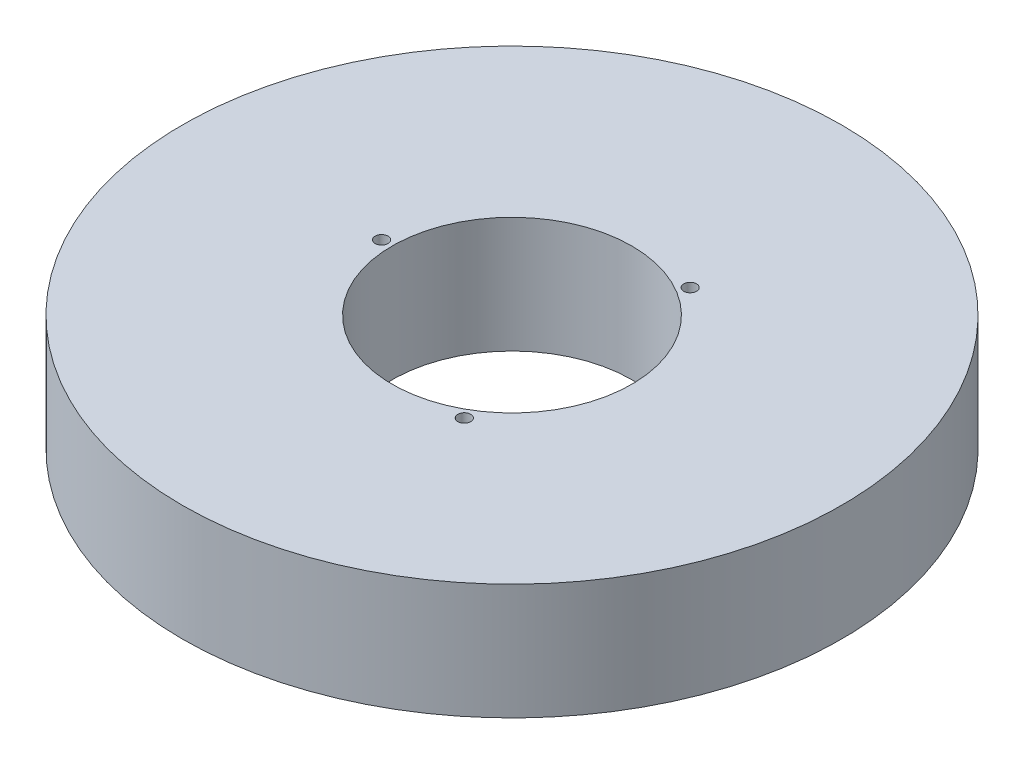
ISO-10303-21;
HEADER;
FILE_DESCRIPTION(('STEP AP214'),'2;1');
FILE_NAME('part.step','',(''),(''),'','','');
FILE_SCHEMA(('AUTOMOTIVE_DESIGN { 1 0 10303 214 1 1 1 1 }'));
ENDSEC;
DATA;
#1=APPLICATION_CONTEXT('core data for automotive mechanical design processes');
#2=APPLICATION_PROTOCOL_DEFINITION('international standard','automotive_design',2000,#1);
#3=PRODUCT_CONTEXT('',#1,'mechanical');
#4=PRODUCT('Part','Part','',(#3));
#5=PRODUCT_RELATED_PRODUCT_CATEGORY('part','',(#4));
#6=PRODUCT_DEFINITION_FORMATION('','',#4);
#7=PRODUCT_DEFINITION_CONTEXT('part definition',#1,'design');
#8=PRODUCT_DEFINITION('design','',#6,#7);
#9=PRODUCT_DEFINITION_SHAPE('','',#8);
#10=(LENGTH_UNIT() NAMED_UNIT(*) SI_UNIT(.MILLI.,.METRE.));
#11=(NAMED_UNIT(*) PLANE_ANGLE_UNIT() SI_UNIT($,.RADIAN.));
#12=(NAMED_UNIT(*) SI_UNIT($,.STERADIAN.) SOLID_ANGLE_UNIT());
#13=UNCERTAINTY_MEASURE_WITH_UNIT(LENGTH_MEASURE(1.E-05),#10,'distance_accuracy_value','');
#14=(GEOMETRIC_REPRESENTATION_CONTEXT(3) GLOBAL_UNCERTAINTY_ASSIGNED_CONTEXT((#13)) GLOBAL_UNIT_ASSIGNED_CONTEXT((#10,
#11,#12)) REPRESENTATION_CONTEXT('',''));
#15=CARTESIAN_POINT('',(0.,0.,0.));
#16=DIRECTION('',(0.,0.,1.));
#17=DIRECTION('',(1.,0.,0.));
#18=AXIS2_PLACEMENT_3D('',#15,#16,#17);
#19=CARTESIAN_POINT('',(0.,29.,0.));
#20=DIRECTION('',(0.,-1.,0.));
#21=DIRECTION('',(0.,0.,-1.));
#22=AXIS2_PLACEMENT_3D('',#19,#20,#21);
#23=CYLINDRICAL_SURFACE('',#22,82.5);
#24=CARTESIAN_POINT('',(0.,29.,0.));
#25=DIRECTION('',(0.,1.,0.));
#26=DIRECTION('',(0.,0.,1.));
#27=AXIS2_PLACEMENT_3D('',#24,#25,#26);
#28=CIRCLE('',#27,82.5);
#29=CARTESIAN_POINT('',(0.,29.,-82.5));
#30=VERTEX_POINT('',#29);
#31=EDGE_CURVE('E10',#30,#30,#28,.T.);
#32=CARTESIAN_POINT('',(0.,0.,0.));
#33=DIRECTION('',(0.,1.,0.));
#34=DIRECTION('',(0.,0.,1.));
#35=AXIS2_PLACEMENT_3D('',#32,#33,#34);
#36=CIRCLE('',#35,82.5);
#37=CARTESIAN_POINT('',(0.,0.,-82.5));
#38=VERTEX_POINT('',#37);
#39=EDGE_CURVE('E37',#38,#38,#36,.T.);
#40=CARTESIAN_POINT('',(0.,29.,-82.5));
#41=CARTESIAN_POINT('',(0.,28.6979166666667,-82.5));
#42=CARTESIAN_POINT('',(0.,28.3958333333333,-82.5));
#43=CARTESIAN_POINT('',(0.,27.7916666666667,-82.5));
#44=CARTESIAN_POINT('',(0.,27.4895833333333,-82.5));
#45=CARTESIAN_POINT('',(0.,26.8854166666667,-82.5));
#46=CARTESIAN_POINT('',(0.,26.5833333333333,-82.5));
#47=CARTESIAN_POINT('',(0.,25.9791666666667,-82.5));
#48=CARTESIAN_POINT('',(0.,25.6770833333333,-82.5));
#49=CARTESIAN_POINT('',(0.,25.0729166666667,-82.5));
#50=CARTESIAN_POINT('',(0.,24.7708333333333,-82.5));
#51=CARTESIAN_POINT('',(0.,24.1666666666667,-82.5));
#52=CARTESIAN_POINT('',(0.,23.8645833333333,-82.5));
#53=CARTESIAN_POINT('',(0.,23.2604166666667,-82.5));
#54=CARTESIAN_POINT('',(0.,22.9583333333333,-82.5));
#55=CARTESIAN_POINT('',(0.,22.3541666666667,-82.5));
#56=CARTESIAN_POINT('',(0.,22.0520833333333,-82.5));
#57=CARTESIAN_POINT('',(0.,21.4479166666667,-82.5));
#58=CARTESIAN_POINT('',(0.,21.1458333333333,-82.5));
#59=CARTESIAN_POINT('',(0.,20.5416666666667,-82.5));
#60=CARTESIAN_POINT('',(0.,20.2395833333333,-82.5));
#61=CARTESIAN_POINT('',(0.,19.6354166666667,-82.5));
#62=CARTESIAN_POINT('',(0.,19.3333333333333,-82.5));
#63=CARTESIAN_POINT('',(0.,18.7291666666667,-82.5));
#64=CARTESIAN_POINT('',(0.,18.4270833333333,-82.5));
#65=CARTESIAN_POINT('',(0.,17.8229166666667,-82.5));
#66=CARTESIAN_POINT('',(0.,17.5208333333333,-82.5));
#67=CARTESIAN_POINT('',(0.,16.9166666666667,-82.5));
#68=CARTESIAN_POINT('',(0.,16.6145833333333,-82.5));
#69=CARTESIAN_POINT('',(0.,16.0104166666667,-82.5));
#70=CARTESIAN_POINT('',(0.,15.7083333333333,-82.5));
#71=CARTESIAN_POINT('',(0.,15.1041666666667,-82.5));
#72=CARTESIAN_POINT('',(0.,14.8020833333333,-82.5));
#73=CARTESIAN_POINT('',(0.,14.1979166666667,-82.5));
#74=CARTESIAN_POINT('',(0.,13.8958333333333,-82.5));
#75=CARTESIAN_POINT('',(0.,13.2916666666667,-82.5));
#76=CARTESIAN_POINT('',(0.,12.9895833333333,-82.5));
#77=CARTESIAN_POINT('',(0.,12.3854166666667,-82.5));
#78=CARTESIAN_POINT('',(0.,12.0833333333333,-82.5));
#79=CARTESIAN_POINT('',(0.,11.4791666666667,-82.5));
#80=CARTESIAN_POINT('',(0.,11.1770833333333,-82.5));
#81=CARTESIAN_POINT('',(0.,10.5729166666667,-82.5));
#82=CARTESIAN_POINT('',(0.,10.2708333333333,-82.5));
#83=CARTESIAN_POINT('',(0.,9.66666666666667,-82.5));
#84=CARTESIAN_POINT('',(0.,9.36458333333333,-82.5));
#85=CARTESIAN_POINT('',(0.,8.76041666666667,-82.5));
#86=CARTESIAN_POINT('',(0.,8.45833333333333,-82.5));
#87=CARTESIAN_POINT('',(0.,7.85416666666667,-82.5));
#88=CARTESIAN_POINT('',(0.,7.55208333333333,-82.5));
#89=CARTESIAN_POINT('',(0.,6.94791666666667,-82.5));
#90=CARTESIAN_POINT('',(0.,6.64583333333333,-82.5));
#91=CARTESIAN_POINT('',(0.,6.04166666666667,-82.5));
#92=CARTESIAN_POINT('',(0.,5.73958333333333,-82.5));
#93=CARTESIAN_POINT('',(0.,5.13541666666667,-82.5));
#94=CARTESIAN_POINT('',(0.,4.83333333333333,-82.5));
#95=CARTESIAN_POINT('',(0.,4.22916666666667,-82.5));
#96=CARTESIAN_POINT('',(0.,3.92708333333333,-82.5));
#97=CARTESIAN_POINT('',(0.,3.32291666666667,-82.5));
#98=CARTESIAN_POINT('',(0.,3.02083333333333,-82.5));
#99=CARTESIAN_POINT('',(0.,2.41666666666667,-82.5));
#100=CARTESIAN_POINT('',(0.,2.11458333333333,-82.5));
#101=CARTESIAN_POINT('',(0.,1.51041666666667,-82.5));
#102=CARTESIAN_POINT('',(0.,1.20833333333333,-82.5));
#103=CARTESIAN_POINT('',(0.,0.604166666666667,-82.5));
#104=CARTESIAN_POINT('',(0.,0.302083333333333,-82.5));
#105=CARTESIAN_POINT('',(0.,0.,-82.5));
#106=B_SPLINE_CURVE_WITH_KNOTS('',3,(#40,#41,#42,#43,#44,#45,#46,#47,#48,#49,#50,#51,#52,#53,
#54,#55,#56,#57,#58,#59,#60,#61,#62,#63,#64,#65,#66,#67,#68,#69,#70,#71,#72,#73,#74,#75,#76,#77,
#78,#79,#80,#81,#82,#83,#84,#85,#86,#87,#88,#89,#90,#91,#92,#93,#94,#95,#96,#97,#98,#99,#100,
#101,#102,#103,#104,#105),.UNSPECIFIED.,.F.,.F.,(4,2,2,2,2,2,2,2,2,2,2,2,2,2,2,2,2,2,2,2,2,2,2,
2,2,2,2,2,2,2,2,2,4),(0.,0.906249999999997,1.8125,2.71875,3.625,4.53125,5.4375,6.34375,7.25,
8.15625,9.0625,9.96875,10.875,11.78125,12.6875,13.59375,14.5,15.40625,16.3125,17.21875,18.125,
19.03125,19.9375,20.84375,21.75,22.65625,23.5625,24.46875,25.375,26.28125,27.1875,28.09375,29.),.UNSPECIFIED.);
#107=EDGE_CURVE('BSEAM40',#30,#38,#106,.T.);
#108=ORIENTED_EDGE('',*,*,#31,.F.);
#109=ORIENTED_EDGE('',*,*,#39,.T.);
#110=ORIENTED_EDGE('',*,*,#107,.T.);
#111=ORIENTED_EDGE('',*,*,#107,.F.);
#112=EDGE_LOOP('',(#108,#110,#109,#111));
#113=FACE_BOUND('',#112,.T.);
#114=ADVANCED_FACE('F40',(#113),#23,.T.);
#115=CARTESIAN_POINT('',(0.,29.,0.));
#116=DIRECTION('',(0.,1.,0.));
#117=DIRECTION('',(0.,0.,1.));
#118=AXIS2_PLACEMENT_3D('',#115,#116,#117);
#119=PLANE('',#118);
#120=CARTESIAN_POINT('',(16.3231577691475,29.,28.2725385961258));
#121=DIRECTION('',(0.,1.,0.));
#122=DIRECTION('',(0.866025403784436,0.,-0.500000000000004));
#123=AXIS2_PLACEMENT_3D('',#120,#121,#122);
#124=CIRCLE('',#123,1.61367320988444);
#125=CARTESIAN_POINT('',(17.7206397623138,29.,27.4657019911835));
#126=VERTEX_POINT('',#125);
#127=EDGE_CURVE('E70',#126,#126,#124,.T.);
#128=ORIENTED_EDGE('',*,*,#127,.F.);
#129=EDGE_LOOP('',(#128));
#130=FACE_BOUND('',#129,.T.);
#131=CARTESIAN_POINT('',(16.3231577691471,29.,-28.272538596126));
#132=DIRECTION('',(0.,1.,0.));
#133=DIRECTION('',(-0.866025403784443,0.,-0.499999999999992));
#134=AXIS2_PLACEMENT_3D('',#131,#132,#133);
#135=CIRCLE('',#134,1.61367320988444);
#136=CARTESIAN_POINT('',(14.9256757759808,29.,-29.0793752010682));
#137=VERTEX_POINT('',#136);
#138=EDGE_CURVE('E61',#137,#137,#135,.T.);
#139=ORIENTED_EDGE('',*,*,#138,.F.);
#140=EDGE_LOOP('',(#139));
#141=FACE_BOUND('',#140,.T.);
#142=CARTESIAN_POINT('',(-32.6463155382947,29.,0.));
#143=DIRECTION('',(0.,1.,0.));
#144=DIRECTION('',(0.,0.,1.));
#145=AXIS2_PLACEMENT_3D('',#142,#143,#144);
#146=CIRCLE('',#145,1.61367320988444);
#147=CARTESIAN_POINT('',(-32.6463155382947,29.,1.61367320988444));
#148=VERTEX_POINT('',#147);
#149=EDGE_CURVE('E54',#148,#148,#146,.T.);
#150=ORIENTED_EDGE('',*,*,#149,.F.);
#151=EDGE_LOOP('',(#150));
#152=FACE_BOUND('',#151,.T.);
#153=CARTESIAN_POINT('',(0.,29.,0.));
#154=DIRECTION('',(0.,1.,0.));
#155=DIRECTION('',(0.,0.,1.));
#156=AXIS2_PLACEMENT_3D('',#153,#154,#155);
#157=CIRCLE('',#156,30.);
#158=CARTESIAN_POINT('',(0.,29.,-30.));
#159=VERTEX_POINT('',#158);
#160=EDGE_CURVE('E50',#159,#159,#157,.T.);
#161=ORIENTED_EDGE('',*,*,#160,.F.);
#162=EDGE_LOOP('',(#161));
#163=FACE_BOUND('',#162,.T.);
#164=ORIENTED_EDGE('',*,*,#31,.T.);
#165=EDGE_LOOP('',(#164));
#166=FACE_BOUND('',#165,.T.);
#167=ADVANCED_FACE('F85',(#130,#141,#152,#163,#166),#119,.T.);
#168=CARTESIAN_POINT('',(0.,0.,0.));
#169=DIRECTION('',(0.,1.,0.));
#170=DIRECTION('',(0.,0.,1.));
#171=AXIS2_PLACEMENT_3D('',#168,#169,#170);
#172=PLANE('',#171);
#173=CARTESIAN_POINT('',(0.,0.,0.));
#174=DIRECTION('',(0.,1.,0.));
#175=DIRECTION('',(0.,0.,1.));
#176=AXIS2_PLACEMENT_3D('',#173,#174,#175);
#177=CIRCLE('',#176,30.);
#178=CARTESIAN_POINT('',(0.,0.,-30.));
#179=VERTEX_POINT('',#178);
#180=EDGE_CURVE('E47',#179,#179,#177,.T.);
#181=ORIENTED_EDGE('',*,*,#180,.T.);
#182=EDGE_LOOP('',(#181));
#183=FACE_BOUND('',#182,.T.);
#184=ORIENTED_EDGE('',*,*,#39,.F.);
#185=EDGE_LOOP('',(#184));
#186=FACE_BOUND('',#185,.T.);
#187=ADVANCED_FACE('F84',(#183,#186),#172,.F.);
#188=CARTESIAN_POINT('',(0.,29.,0.));
#189=DIRECTION('',(0.,-1.,0.));
#190=DIRECTION('',(0.,0.,-1.));
#191=AXIS2_PLACEMENT_3D('',#188,#189,#190);
#192=CYLINDRICAL_SURFACE('',#191,30.);
#193=CARTESIAN_POINT('',(0.,29.,-30.));
#194=CARTESIAN_POINT('',(0.,28.6979166666667,-30.));
#195=CARTESIAN_POINT('',(0.,28.3958333333333,-30.));
#196=CARTESIAN_POINT('',(0.,27.7916666666667,-30.));
#197=CARTESIAN_POINT('',(0.,27.4895833333333,-30.));
#198=CARTESIAN_POINT('',(0.,26.8854166666667,-30.));
#199=CARTESIAN_POINT('',(0.,26.5833333333333,-30.));
#200=CARTESIAN_POINT('',(0.,25.9791666666667,-30.));
#201=CARTESIAN_POINT('',(0.,25.6770833333333,-30.));
#202=CARTESIAN_POINT('',(0.,25.0729166666667,-30.));
#203=CARTESIAN_POINT('',(0.,24.7708333333333,-30.));
#204=CARTESIAN_POINT('',(0.,24.1666666666667,-30.));
#205=CARTESIAN_POINT('',(0.,23.8645833333333,-30.));
#206=CARTESIAN_POINT('',(0.,23.2604166666667,-30.));
#207=CARTESIAN_POINT('',(0.,22.9583333333333,-30.));
#208=CARTESIAN_POINT('',(0.,22.3541666666667,-30.));
#209=CARTESIAN_POINT('',(0.,22.0520833333333,-30.));
#210=CARTESIAN_POINT('',(0.,21.4479166666667,-30.));
#211=CARTESIAN_POINT('',(0.,21.1458333333333,-30.));
#212=CARTESIAN_POINT('',(0.,20.5416666666667,-30.));
#213=CARTESIAN_POINT('',(0.,20.2395833333333,-30.));
#214=CARTESIAN_POINT('',(0.,19.6354166666667,-30.));
#215=CARTESIAN_POINT('',(0.,19.3333333333333,-30.));
#216=CARTESIAN_POINT('',(0.,18.7291666666667,-30.));
#217=CARTESIAN_POINT('',(0.,18.4270833333333,-30.));
#218=CARTESIAN_POINT('',(0.,17.8229166666667,-30.));
#219=CARTESIAN_POINT('',(0.,17.5208333333333,-30.));
#220=CARTESIAN_POINT('',(0.,16.9166666666667,-30.));
#221=CARTESIAN_POINT('',(0.,16.6145833333333,-30.));
#222=CARTESIAN_POINT('',(0.,16.0104166666667,-30.));
#223=CARTESIAN_POINT('',(0.,15.7083333333333,-30.));
#224=CARTESIAN_POINT('',(0.,15.1041666666667,-30.));
#225=CARTESIAN_POINT('',(0.,14.8020833333333,-30.));
#226=CARTESIAN_POINT('',(0.,14.1979166666667,-30.));
#227=CARTESIAN_POINT('',(0.,13.8958333333333,-30.));
#228=CARTESIAN_POINT('',(0.,13.2916666666667,-30.));
#229=CARTESIAN_POINT('',(0.,12.9895833333333,-30.));
#230=CARTESIAN_POINT('',(0.,12.3854166666667,-30.));
#231=CARTESIAN_POINT('',(0.,12.0833333333333,-30.));
#232=CARTESIAN_POINT('',(0.,11.4791666666667,-30.));
#233=CARTESIAN_POINT('',(0.,11.1770833333333,-30.));
#234=CARTESIAN_POINT('',(0.,10.5729166666667,-30.));
#235=CARTESIAN_POINT('',(0.,10.2708333333333,-30.));
#236=CARTESIAN_POINT('',(0.,9.66666666666667,-30.));
#237=CARTESIAN_POINT('',(0.,9.36458333333333,-30.));
#238=CARTESIAN_POINT('',(0.,8.76041666666667,-30.));
#239=CARTESIAN_POINT('',(0.,8.45833333333333,-30.));
#240=CARTESIAN_POINT('',(0.,7.85416666666667,-30.));
#241=CARTESIAN_POINT('',(0.,7.55208333333333,-30.));
#242=CARTESIAN_POINT('',(0.,6.94791666666667,-30.));
#243=CARTESIAN_POINT('',(0.,6.64583333333333,-30.));
#244=CARTESIAN_POINT('',(0.,6.04166666666667,-30.));
#245=CARTESIAN_POINT('',(0.,5.73958333333333,-30.));
#246=CARTESIAN_POINT('',(0.,5.13541666666667,-30.));
#247=CARTESIAN_POINT('',(0.,4.83333333333333,-30.));
#248=CARTESIAN_POINT('',(0.,4.22916666666667,-30.));
#249=CARTESIAN_POINT('',(0.,3.92708333333333,-30.));
#250=CARTESIAN_POINT('',(0.,3.32291666666667,-30.));
#251=CARTESIAN_POINT('',(0.,3.02083333333333,-30.));
#252=CARTESIAN_POINT('',(0.,2.41666666666667,-30.));
#253=CARTESIAN_POINT('',(0.,2.11458333333333,-30.));
#254=CARTESIAN_POINT('',(0.,1.51041666666667,-30.));
#255=CARTESIAN_POINT('',(0.,1.20833333333333,-30.));
#256=CARTESIAN_POINT('',(0.,0.604166666666667,-30.));
#257=CARTESIAN_POINT('',(0.,0.302083333333333,-30.));
#258=CARTESIAN_POINT('',(0.,0.,-30.));
#259=B_SPLINE_CURVE_WITH_KNOTS('',3,(#193,#194,#195,#196,#197,#198,#199,#200,#201,#202,#203,
#204,#205,#206,#207,#208,#209,#210,#211,#212,#213,#214,#215,#216,#217,#218,#219,#220,#221,#222,
#223,#224,#225,#226,#227,#228,#229,#230,#231,#232,#233,#234,#235,#236,#237,#238,#239,#240,#241,
#242,#243,#244,#245,#246,#247,#248,#249,#250,#251,#252,#253,#254,#255,#256,#257,#258),
.UNSPECIFIED.,.F.,.F.,(4,2,2,2,2,2,2,2,2,2,2,2,2,2,2,2,2,2,2,2,2,2,2,2,2,2,2,2,2,2,2,2,4),(0.,
0.906249999999997,1.8125,2.71875,3.625,4.53125,5.4375,6.34375,7.25,8.15625,9.0625,9.96875,
10.875,11.78125,12.6875,13.59375,14.5,15.40625,16.3125,17.21875,18.125,19.03125,19.9375,
20.84375,21.75,22.65625,23.5625,24.46875,25.375,26.28125,27.1875,28.09375,29.),.UNSPECIFIED.);
#260=EDGE_CURVE('BSEAM91',#159,#179,#259,.T.);
#261=ORIENTED_EDGE('',*,*,#160,.T.);
#262=ORIENTED_EDGE('',*,*,#180,.F.);
#263=ORIENTED_EDGE('',*,*,#260,.T.);
#264=ORIENTED_EDGE('',*,*,#260,.F.);
#265=EDGE_LOOP('',(#261,#263,#262,#264));
#266=FACE_BOUND('',#265,.T.);
#267=ADVANCED_FACE('F91',(#266),#192,.F.);
#268=CARTESIAN_POINT('',(-32.6463155382947,10.1740859891861,0.));
#269=DIRECTION('',(0.,1.,0.));
#270=DIRECTION('',(0.,0.,1.));
#271=AXIS2_PLACEMENT_3D('',#268,#269,#270);
#272=CYLINDRICAL_SURFACE('',#271,1.61367320988444);
#273=CARTESIAN_POINT('',(-32.6463155382947,10.1740859891861,0.));
#274=DIRECTION('',(0.,1.,0.));
#275=DIRECTION('',(0.,0.,1.));
#276=AXIS2_PLACEMENT_3D('',#273,#274,#275);
#277=CIRCLE('',#276,1.61367320988444);
#278=CARTESIAN_POINT('',(-32.6463155382947,10.1740859891861,1.61367320988444));
#279=VERTEX_POINT('',#278);
#280=EDGE_CURVE('E55',#279,#279,#277,.T.);
#281=ORIENTED_EDGE('',*,*,#280,.F.);
#282=EDGE_LOOP('',(#281));
#283=FACE_BOUND('',#282,.T.);
#284=ORIENTED_EDGE('',*,*,#149,.T.);
#285=EDGE_LOOP('',(#284));
#286=FACE_BOUND('',#285,.T.);
#287=ADVANCED_FACE('F96',(#283,#286),#272,.F.);
#288=CARTESIAN_POINT('',(-32.6463155382947,10.1740859891861,0.));
#289=DIRECTION('',(0.,1.,0.));
#290=DIRECTION('',(0.,0.,1.));
#291=AXIS2_PLACEMENT_3D('',#288,#289,#290);
#292=PLANE('',#291);
#293=ORIENTED_EDGE('',*,*,#280,.T.);
#294=EDGE_LOOP('',(#293));
#295=FACE_BOUND('',#294,.T.);
#296=ADVANCED_FACE('F127',(#295),#292,.T.);
#297=CARTESIAN_POINT('',(16.3231577691471,10.1740859891861,-28.272538596126));
#298=DIRECTION('',(0.,1.,0.));
#299=DIRECTION('',(0.,0.,1.));
#300=AXIS2_PLACEMENT_3D('',#297,#298,#299);
#301=CYLINDRICAL_SURFACE('',#300,1.61367320988444);
#302=CARTESIAN_POINT('',(16.3231577691471,10.1740859891861,-28.272538596126));
#303=DIRECTION('',(0.,1.,0.));
#304=DIRECTION('',(-0.866025403784443,0.,-0.499999999999992));
#305=AXIS2_PLACEMENT_3D('',#302,#303,#304);
#306=CIRCLE('',#305,1.61367320988444);
#307=CARTESIAN_POINT('',(14.9256757759808,10.1740859891861,-29.0793752010682));
#308=VERTEX_POINT('',#307);
#309=EDGE_CURVE('E63',#308,#308,#306,.T.);
#310=ORIENTED_EDGE('',*,*,#309,.F.);
#311=EDGE_LOOP('',(#310));
#312=FACE_BOUND('',#311,.T.);
#313=ORIENTED_EDGE('',*,*,#138,.T.);
#314=EDGE_LOOP('',(#313));
#315=FACE_BOUND('',#314,.T.);
#316=ADVANCED_FACE('F133',(#312,#315),#301,.F.);
#317=CARTESIAN_POINT('',(16.3231577691471,10.1740859891861,-28.272538596126));
#318=DIRECTION('',(0.,1.,0.));
#319=DIRECTION('',(-0.866025403784443,0.,-0.499999999999992));
#320=AXIS2_PLACEMENT_3D('',#317,#318,#319);
#321=PLANE('',#320);
#322=ORIENTED_EDGE('',*,*,#309,.T.);
#323=EDGE_LOOP('',(#322));
#324=FACE_BOUND('',#323,.T.);
#325=ADVANCED_FACE('F77',(#324),#321,.T.);
#326=CARTESIAN_POINT('',(16.3231577691475,10.1740859891861,28.2725385961258));
#327=DIRECTION('',(0.,1.,0.));
#328=DIRECTION('',(0.,0.,1.));
#329=AXIS2_PLACEMENT_3D('',#326,#327,#328);
#330=CYLINDRICAL_SURFACE('',#329,1.61367320988444);
#331=CARTESIAN_POINT('',(16.3231577691475,10.1740859891861,28.2725385961258));
#332=DIRECTION('',(0.,1.,0.));
#333=DIRECTION('',(0.866025403784436,0.,-0.500000000000004));
#334=AXIS2_PLACEMENT_3D('',#331,#332,#333);
#335=CIRCLE('',#334,1.61367320988444);
#336=CARTESIAN_POINT('',(17.7206397623138,10.1740859891861,27.4657019911835));
#337=VERTEX_POINT('',#336);
#338=EDGE_CURVE('E59',#337,#337,#335,.T.);
#339=ORIENTED_EDGE('',*,*,#338,.F.);
#340=EDGE_LOOP('',(#339));
#341=FACE_BOUND('',#340,.T.);
#342=ORIENTED_EDGE('',*,*,#127,.T.);
#343=EDGE_LOOP('',(#342));
#344=FACE_BOUND('',#343,.T.);
#345=ADVANCED_FACE('F73',(#341,#344),#330,.F.);
#346=CARTESIAN_POINT('',(16.3231577691475,10.1740859891861,28.2725385961258));
#347=DIRECTION('',(0.,1.,0.));
#348=DIRECTION('',(0.866025403784436,0.,-0.500000000000004));
#349=AXIS2_PLACEMENT_3D('',#346,#347,#348);
#350=PLANE('',#349);
#351=ORIENTED_EDGE('',*,*,#338,.T.);
#352=EDGE_LOOP('',(#351));
#353=FACE_BOUND('',#352,.T.);
#354=ADVANCED_FACE('F71',(#353),#350,.T.);
#355=CLOSED_SHELL('',(#114,#167,#187,#267,#287,#296,#316,#325,#345,#354));
#356=MANIFOLD_SOLID_BREP('B2',#355);
#357=ADVANCED_BREP_SHAPE_REPRESENTATION('',(#18,#356),#14);
#358=SHAPE_DEFINITION_REPRESENTATION(#9,#357);
ENDSEC;
END-ISO-10303-21;
